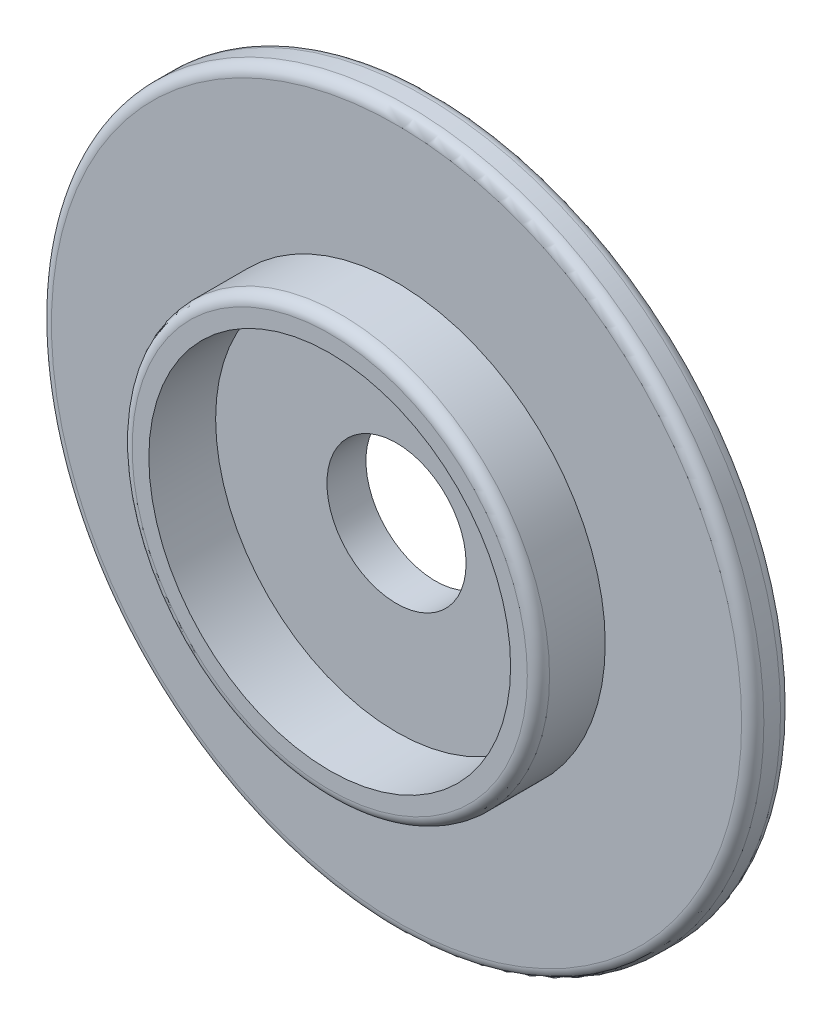
ISO-10303-21;
HEADER;
FILE_DESCRIPTION(('STEP AP214'),'2;1');
FILE_NAME('part.step','',(''),(''),'','','');
FILE_SCHEMA(('AUTOMOTIVE_DESIGN { 1 0 10303 214 1 1 1 1 }'));
ENDSEC;
DATA;
#1=APPLICATION_CONTEXT('core data for automotive mechanical design processes');
#2=APPLICATION_PROTOCOL_DEFINITION('international standard','automotive_design',2000,#1);
#3=PRODUCT_CONTEXT('',#1,'mechanical');
#4=PRODUCT('Part','Part','',(#3));
#5=PRODUCT_RELATED_PRODUCT_CATEGORY('part','',(#4));
#6=PRODUCT_DEFINITION_FORMATION('','',#4);
#7=PRODUCT_DEFINITION_CONTEXT('part definition',#1,'design');
#8=PRODUCT_DEFINITION('design','',#6,#7);
#9=PRODUCT_DEFINITION_SHAPE('','',#8);
#10=(LENGTH_UNIT() NAMED_UNIT(*) SI_UNIT(.MILLI.,.METRE.));
#11=(NAMED_UNIT(*) PLANE_ANGLE_UNIT() SI_UNIT($,.RADIAN.));
#12=(NAMED_UNIT(*) SI_UNIT($,.STERADIAN.) SOLID_ANGLE_UNIT());
#13=UNCERTAINTY_MEASURE_WITH_UNIT(LENGTH_MEASURE(1.E-05),#10,'distance_accuracy_value','');
#14=(GEOMETRIC_REPRESENTATION_CONTEXT(3) GLOBAL_UNCERTAINTY_ASSIGNED_CONTEXT((#13)) GLOBAL_UNIT_ASSIGNED_CONTEXT((#10,
#11,#12)) REPRESENTATION_CONTEXT('',''));
#15=CARTESIAN_POINT('',(0.,0.,0.));
#16=DIRECTION('',(0.,0.,1.));
#17=DIRECTION('',(1.,0.,0.));
#18=AXIS2_PLACEMENT_3D('',#15,#16,#17);
#19=CARTESIAN_POINT('',(0.,0.,7.));
#20=DIRECTION('',(0.,0.,-1.));
#21=DIRECTION('',(-1.,0.,0.));
#22=AXIS2_PLACEMENT_3D('',#19,#20,#21);
#23=CYLINDRICAL_SURFACE('',#22,64.);
#24=CARTESIAN_POINT('',(0.,0.,2.));
#25=DIRECTION('',(0.,0.,1.));
#26=DIRECTION('',(1.,0.,0.));
#27=AXIS2_PLACEMENT_3D('',#24,#25,#26);
#28=CIRCLE('',#27,64.);
#29=CARTESIAN_POINT('',(64.,0.,2.));
#30=VERTEX_POINT('',#29);
#31=EDGE_CURVE('E51',#30,#30,#28,.T.);
#32=ORIENTED_EDGE('',*,*,#31,.T.);
#33=EDGE_LOOP('',(#32));
#34=FACE_BOUND('',#33,.T.);
#35=CARTESIAN_POINT('',(0.,0.,5.));
#36=DIRECTION('',(0.,0.,1.));
#37=DIRECTION('',(1.,0.,0.));
#38=AXIS2_PLACEMENT_3D('',#35,#36,#37);
#39=CIRCLE('',#38,64.);
#40=CARTESIAN_POINT('',(64.,0.,5.));
#41=VERTEX_POINT('',#40);
#42=EDGE_CURVE('E54',#41,#41,#39,.F.);
#43=ORIENTED_EDGE('',*,*,#42,.T.);
#44=EDGE_LOOP('',(#43));
#45=FACE_BOUND('',#44,.T.);
#46=ADVANCED_FACE('F31',(#34,#45),#23,.T.);
#47=CARTESIAN_POINT('',(0.,0.,7.));
#48=DIRECTION('',(0.,0.,1.));
#49=DIRECTION('',(1.,0.,0.));
#50=AXIS2_PLACEMENT_3D('',#47,#48,#49);
#51=PLANE('',#50);
#52=CARTESIAN_POINT('',(0.,0.,7.));
#53=DIRECTION('',(0.,0.,1.));
#54=DIRECTION('',(1.,0.,0.));
#55=AXIS2_PLACEMENT_3D('',#52,#53,#54);
#56=CIRCLE('',#55,62.);
#57=CARTESIAN_POINT('',(62.,0.,7.));
#58=VERTEX_POINT('',#57);
#59=EDGE_CURVE('E42',#58,#58,#56,.T.);
#60=ORIENTED_EDGE('',*,*,#59,.T.);
#61=EDGE_LOOP('',(#60));
#62=FACE_BOUND('',#61,.T.);
#63=CARTESIAN_POINT('',(0.,0.,7.));
#64=DIRECTION('',(0.,0.,1.));
#65=DIRECTION('',(1.,0.,0.));
#66=AXIS2_PLACEMENT_3D('',#63,#64,#65);
#67=CIRCLE('',#66,37.5);
#68=CARTESIAN_POINT('',(37.5,0.,7.));
#69=VERTEX_POINT('',#68);
#70=EDGE_CURVE('E60',#69,#69,#67,.T.);
#71=ORIENTED_EDGE('',*,*,#70,.F.);
#72=EDGE_LOOP('',(#71));
#73=FACE_BOUND('',#72,.T.);
#74=ADVANCED_FACE('F87',(#62,#73),#51,.T.);
#75=CARTESIAN_POINT('',(0.,0.,0.));
#76=DIRECTION('',(0.,0.,1.));
#77=DIRECTION('',(1.,0.,0.));
#78=AXIS2_PLACEMENT_3D('',#75,#76,#77);
#79=PLANE('',#78);
#80=CARTESIAN_POINT('',(0.,0.,0.));
#81=DIRECTION('',(0.,0.,1.));
#82=DIRECTION('',(1.,0.,0.));
#83=AXIS2_PLACEMENT_3D('',#80,#81,#82);
#84=CIRCLE('',#83,62.);
#85=CARTESIAN_POINT('',(62.,0.,0.));
#86=VERTEX_POINT('',#85);
#87=EDGE_CURVE('E46',#86,#86,#84,.F.);
#88=ORIENTED_EDGE('',*,*,#87,.T.);
#89=EDGE_LOOP('',(#88));
#90=FACE_BOUND('',#89,.T.);
#91=CARTESIAN_POINT('',(0.,0.,0.));
#92=DIRECTION('',(0.,0.,1.));
#93=DIRECTION('',(1.,0.,0.));
#94=AXIS2_PLACEMENT_3D('',#91,#92,#93);
#95=CIRCLE('',#94,12.5);
#96=CARTESIAN_POINT('',(12.5,0.,0.));
#97=VERTEX_POINT('',#96);
#98=EDGE_CURVE('E66',#97,#97,#95,.T.);
#99=ORIENTED_EDGE('',*,*,#98,.T.);
#100=EDGE_LOOP('',(#99));
#101=FACE_BOUND('',#100,.T.);
#102=ADVANCED_FACE('F73',(#90,#101),#79,.F.);
#103=CARTESIAN_POINT('',(0.,0.,19.));
#104=DIRECTION('',(0.,0.,1.));
#105=DIRECTION('',(1.,0.,0.));
#106=AXIS2_PLACEMENT_3D('',#103,#104,#105);
#107=PLANE('',#106);
#108=CARTESIAN_POINT('',(0.,0.,19.));
#109=DIRECTION('',(0.,0.,1.));
#110=DIRECTION('',(1.,0.,0.));
#111=AXIS2_PLACEMENT_3D('',#108,#109,#110);
#112=CIRCLE('',#111,35.5);
#113=CARTESIAN_POINT('',(35.5,0.,19.));
#114=VERTEX_POINT('',#113);
#115=EDGE_CURVE('E38',#114,#114,#112,.T.);
#116=ORIENTED_EDGE('',*,*,#115,.T.);
#117=EDGE_LOOP('',(#116));
#118=FACE_BOUND('',#117,.T.);
#119=CARTESIAN_POINT('',(0.,0.,19.));
#120=DIRECTION('',(0.,0.,1.));
#121=DIRECTION('',(1.,0.,0.));
#122=AXIS2_PLACEMENT_3D('',#119,#120,#121);
#123=CIRCLE('',#122,32.5);
#124=CARTESIAN_POINT('',(32.5,0.,19.));
#125=VERTEX_POINT('',#124);
#126=EDGE_CURVE('E63',#125,#125,#123,.T.);
#127=ORIENTED_EDGE('',*,*,#126,.F.);
#128=EDGE_LOOP('',(#127));
#129=FACE_BOUND('',#128,.T.);
#130=ADVANCED_FACE('F97',(#118,#129),#107,.T.);
#131=CARTESIAN_POINT('',(0.,0.,19.));
#132=DIRECTION('',(0.,0.,-1.));
#133=DIRECTION('',(-1.,0.,0.));
#134=AXIS2_PLACEMENT_3D('',#131,#132,#133);
#135=CYLINDRICAL_SURFACE('',#134,37.5);
#136=CARTESIAN_POINT('',(0.,0.,17.));
#137=DIRECTION('',(0.,0.,1.));
#138=DIRECTION('',(1.,0.,0.));
#139=AXIS2_PLACEMENT_3D('',#136,#137,#138);
#140=CIRCLE('',#139,37.5);
#141=CARTESIAN_POINT('',(37.5,0.,17.));
#142=VERTEX_POINT('',#141);
#143=EDGE_CURVE('E10',#142,#142,#140,.F.);
#144=ORIENTED_EDGE('',*,*,#143,.T.);
#145=EDGE_LOOP('',(#144));
#146=FACE_BOUND('',#145,.T.);
#147=ORIENTED_EDGE('',*,*,#70,.T.);
#148=EDGE_LOOP('',(#147));
#149=FACE_BOUND('',#148,.T.);
#150=ADVANCED_FACE('F91',(#146,#149),#135,.T.);
#151=CARTESIAN_POINT('',(0.,0.,19.));
#152=DIRECTION('',(0.,0.,-1.));
#153=DIRECTION('',(-1.,0.,0.));
#154=AXIS2_PLACEMENT_3D('',#151,#152,#153);
#155=CYLINDRICAL_SURFACE('',#154,32.5);
#156=ORIENTED_EDGE('',*,*,#126,.T.);
#157=EDGE_LOOP('',(#156));
#158=FACE_BOUND('',#157,.T.);
#159=CARTESIAN_POINT('',(0.,0.,7.));
#160=DIRECTION('',(0.,0.,1.));
#161=DIRECTION('',(1.,0.,0.));
#162=AXIS2_PLACEMENT_3D('',#159,#160,#161);
#163=CIRCLE('',#162,32.5);
#164=CARTESIAN_POINT('',(32.5,0.,7.));
#165=VERTEX_POINT('',#164);
#166=EDGE_CURVE('E57',#165,#165,#163,.F.);
#167=ORIENTED_EDGE('',*,*,#166,.T.);
#168=EDGE_LOOP('',(#167));
#169=FACE_BOUND('',#168,.T.);
#170=ADVANCED_FACE('F85',(#158,#169),#155,.F.);
#171=CARTESIAN_POINT('',(0.,0.,7.));
#172=DIRECTION('',(0.,0.,1.));
#173=DIRECTION('',(1.,0.,0.));
#174=AXIS2_PLACEMENT_3D('',#171,#172,#173);
#175=CIRCLE('',#174,12.5);
#176=CARTESIAN_POINT('',(12.5,0.,7.));
#177=VERTEX_POINT('',#176);
#178=EDGE_CURVE('E67',#177,#177,#175,.T.);
#179=ORIENTED_EDGE('',*,*,#178,.F.);
#180=EDGE_LOOP('',(#179));
#181=FACE_BOUND('',#180,.T.);
#182=ORIENTED_EDGE('',*,*,#166,.F.);
#183=EDGE_LOOP('',(#182));
#184=FACE_BOUND('',#183,.T.);
#185=ADVANCED_FACE('F79',(#181,#184),#51,.T.);
#186=CARTESIAN_POINT('',(0.,0.,0.));
#187=DIRECTION('',(0.,0.,1.));
#188=DIRECTION('',(1.,0.,0.));
#189=AXIS2_PLACEMENT_3D('',#186,#187,#188);
#190=CYLINDRICAL_SURFACE('',#189,12.5);
#191=ORIENTED_EDGE('',*,*,#98,.F.);
#192=EDGE_LOOP('',(#191));
#193=FACE_BOUND('',#192,.T.);
#194=ORIENTED_EDGE('',*,*,#178,.T.);
#195=EDGE_LOOP('',(#194));
#196=FACE_BOUND('',#195,.T.);
#197=ADVANCED_FACE('F75',(#193,#196),#190,.F.);
#198=CARTESIAN_POINT('',(0.,0.,2.));
#199=DIRECTION('',(0.,0.,1.));
#200=DIRECTION('',(1.,0.,0.));
#201=AXIS2_PLACEMENT_3D('',#198,#199,#200);
#202=TOROIDAL_SURFACE('',#201,62.,2.);
#203=ORIENTED_EDGE('',*,*,#87,.F.);
#204=EDGE_LOOP('',(#203));
#205=FACE_BOUND('',#204,.T.);
#206=ORIENTED_EDGE('',*,*,#31,.F.);
#207=EDGE_LOOP('',(#206));
#208=FACE_BOUND('',#207,.T.);
#209=ADVANCED_FACE('F78',(#205,#208),#202,.T.);
#210=CARTESIAN_POINT('',(0.,0.,5.));
#211=DIRECTION('',(0.,0.,1.));
#212=DIRECTION('',(1.,0.,0.));
#213=AXIS2_PLACEMENT_3D('',#210,#211,#212);
#214=TOROIDAL_SURFACE('',#213,62.,2.);
#215=ORIENTED_EDGE('',*,*,#42,.F.);
#216=EDGE_LOOP('',(#215));
#217=FACE_BOUND('',#216,.T.);
#218=ORIENTED_EDGE('',*,*,#59,.F.);
#219=EDGE_LOOP('',(#218));
#220=FACE_BOUND('',#219,.T.);
#221=ADVANCED_FACE('F111',(#217,#220),#214,.T.);
#222=CARTESIAN_POINT('',(0.,0.,17.));
#223=DIRECTION('',(0.,0.,1.));
#224=DIRECTION('',(1.,0.,0.));
#225=AXIS2_PLACEMENT_3D('',#222,#223,#224);
#226=TOROIDAL_SURFACE('',#225,35.5,2.);
#227=ORIENTED_EDGE('',*,*,#143,.F.);
#228=EDGE_LOOP('',(#227));
#229=FACE_BOUND('',#228,.T.);
#230=ORIENTED_EDGE('',*,*,#115,.F.);
#231=EDGE_LOOP('',(#230));
#232=FACE_BOUND('',#231,.T.);
#233=ADVANCED_FACE('F33',(#229,#232),#226,.T.);
#234=CLOSED_SHELL('',(#46,#74,#102,#130,#150,#170,#185,#197,#209,#221,#233));
#235=MANIFOLD_SOLID_BREP('B2',#234);
#236=ADVANCED_BREP_SHAPE_REPRESENTATION('',(#18,#235),#14);
#237=SHAPE_DEFINITION_REPRESENTATION(#9,#236);
ENDSEC;
END-ISO-10303-21;
